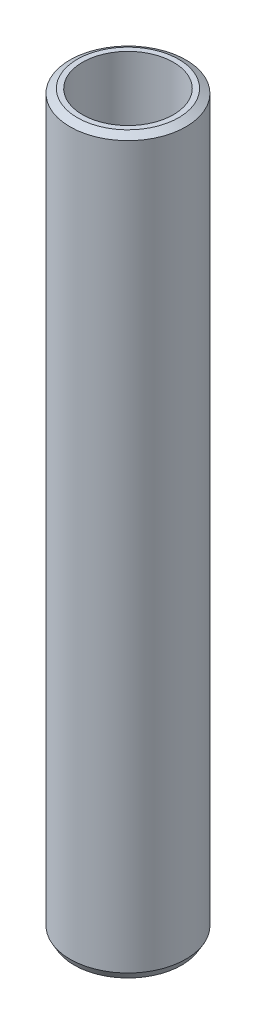
ISO-10303-21;
HEADER;
FILE_DESCRIPTION(('STEP AP214'),'2;1');
FILE_NAME('part.step','',(''),(''),'','','');
FILE_SCHEMA(('AUTOMOTIVE_DESIGN { 1 0 10303 214 1 1 1 1 }'));
ENDSEC;
DATA;
#1=APPLICATION_CONTEXT('core data for automotive mechanical design processes');
#2=APPLICATION_PROTOCOL_DEFINITION('international standard','automotive_design',2000,#1);
#3=PRODUCT_CONTEXT('',#1,'mechanical');
#4=PRODUCT('Part','Part','',(#3));
#5=PRODUCT_RELATED_PRODUCT_CATEGORY('part','',(#4));
#6=PRODUCT_DEFINITION_FORMATION('','',#4);
#7=PRODUCT_DEFINITION_CONTEXT('part definition',#1,'design');
#8=PRODUCT_DEFINITION('design','',#6,#7);
#9=PRODUCT_DEFINITION_SHAPE('','',#8);
#10=(LENGTH_UNIT() NAMED_UNIT(*) SI_UNIT(.MILLI.,.METRE.));
#11=(NAMED_UNIT(*) PLANE_ANGLE_UNIT() SI_UNIT($,.RADIAN.));
#12=(NAMED_UNIT(*) SI_UNIT($,.STERADIAN.) SOLID_ANGLE_UNIT());
#13=UNCERTAINTY_MEASURE_WITH_UNIT(LENGTH_MEASURE(1.E-05),#10,'distance_accuracy_value','');
#14=(GEOMETRIC_REPRESENTATION_CONTEXT(3) GLOBAL_UNCERTAINTY_ASSIGNED_CONTEXT((#13)) GLOBAL_UNIT_ASSIGNED_CONTEXT((#10,
#11,#12)) REPRESENTATION_CONTEXT('',''));
#15=CARTESIAN_POINT('',(0.,0.,0.));
#16=DIRECTION('',(0.,0.,1.));
#17=DIRECTION('',(1.,0.,0.));
#18=AXIS2_PLACEMENT_3D('',#15,#16,#17);
#19=CARTESIAN_POINT('',(0.,600.,0.));
#20=DIRECTION('',(0.,-1.,0.));
#21=DIRECTION('',(0.,0.,-1.));
#22=AXIS2_PLACEMENT_3D('',#19,#20,#21);
#23=CYLINDRICAL_SURFACE('',#22,47.5);
#24=CARTESIAN_POINT('',(0.,596.544630793813,0.));
#25=DIRECTION('',(0.,1.,0.));
#26=DIRECTION('',(0.,0.,1.));
#27=AXIS2_PLACEMENT_3D('',#24,#25,#26);
#28=CIRCLE('',#27,47.5);
#29=CARTESIAN_POINT('',(0.,596.544630793813,47.5));
#30=VERTEX_POINT('',#29);
#31=EDGE_CURVE('E50',#30,#30,#28,.F.);
#32=ORIENTED_EDGE('',*,*,#31,.T.);
#33=EDGE_LOOP('',(#32));
#34=FACE_BOUND('',#33,.T.);
#35=CARTESIAN_POINT('',(0.,5.98487502402389,0.));
#36=DIRECTION('',(0.,1.,0.));
#37=DIRECTION('',(0.,0.,1.));
#38=AXIS2_PLACEMENT_3D('',#35,#36,#37);
#39=CIRCLE('',#38,47.5);
#40=CARTESIAN_POINT('',(0.,5.98487502402389,47.5));
#41=VERTEX_POINT('',#40);
#42=EDGE_CURVE('E51',#41,#41,#39,.T.);
#43=ORIENTED_EDGE('',*,*,#42,.T.);
#44=EDGE_LOOP('',(#43));
#45=FACE_BOUND('',#44,.T.);
#46=ADVANCED_FACE('F39',(#34,#45),#23,.T.);
#47=CARTESIAN_POINT('',(0.,600.,0.));
#48=DIRECTION('',(0.,1.,0.));
#49=DIRECTION('',(0.,0.,1.));
#50=AXIS2_PLACEMENT_3D('',#47,#48,#49);
#51=PLANE('',#50);
#52=CARTESIAN_POINT('',(0.,600.,0.));
#53=DIRECTION('',(0.,1.,0.));
#54=DIRECTION('',(0.,0.,1.));
#55=AXIS2_PLACEMENT_3D('',#52,#53,#54);
#56=CIRCLE('',#55,41.5151249759758);
#57=CARTESIAN_POINT('',(0.,600.,41.5151249759758));
#58=VERTEX_POINT('',#57);
#59=EDGE_CURVE('E54',#58,#58,#56,.T.);
#60=ORIENTED_EDGE('',*,*,#59,.T.);
#61=EDGE_LOOP('',(#60));
#62=FACE_BOUND('',#61,.T.);
#63=CARTESIAN_POINT('',(0.,600.,0.));
#64=DIRECTION('',(0.,1.,0.));
#65=DIRECTION('',(0.,0.,1.));
#66=AXIS2_PLACEMENT_3D('',#63,#64,#65);
#67=CIRCLE('',#66,37.2601725460857);
#68=CARTESIAN_POINT('',(0.,600.,37.2601725460857));
#69=VERTEX_POINT('',#68);
#70=EDGE_CURVE('E58',#69,#69,#67,.T.);
#71=ORIENTED_EDGE('',*,*,#70,.F.);
#72=EDGE_LOOP('',(#71));
#73=FACE_BOUND('',#72,.T.);
#74=ADVANCED_FACE('F69',(#62,#73),#51,.T.);
#75=CARTESIAN_POINT('',(0.,0.,0.));
#76=DIRECTION('',(0.,1.,0.));
#77=DIRECTION('',(0.,0.,1.));
#78=AXIS2_PLACEMENT_3D('',#75,#76,#77);
#79=PLANE('',#78);
#80=CARTESIAN_POINT('',(0.,0.,0.));
#81=DIRECTION('',(0.,1.,0.));
#82=DIRECTION('',(0.,0.,1.));
#83=AXIS2_PLACEMENT_3D('',#80,#81,#82);
#84=CIRCLE('',#83,44.0446307938135);
#85=CARTESIAN_POINT('',(0.,0.,44.0446307938135));
#86=VERTEX_POINT('',#85);
#87=EDGE_CURVE('E10',#86,#86,#84,.F.);
#88=ORIENTED_EDGE('',*,*,#87,.T.);
#89=EDGE_LOOP('',(#88));
#90=FACE_BOUND('',#89,.T.);
#91=CARTESIAN_POINT('',(0.,0.,0.));
#92=DIRECTION('',(0.,1.,0.));
#93=DIRECTION('',(0.,0.,1.));
#94=AXIS2_PLACEMENT_3D('',#91,#92,#93);
#95=CIRCLE('',#94,37.2601725460857);
#96=CARTESIAN_POINT('',(0.,0.,37.2601725460857));
#97=VERTEX_POINT('',#96);
#98=EDGE_CURVE('E63',#97,#97,#95,.T.);
#99=ORIENTED_EDGE('',*,*,#98,.T.);
#100=EDGE_LOOP('',(#99));
#101=FACE_BOUND('',#100,.T.);
#102=ADVANCED_FACE('F75',(#90,#101),#79,.F.);
#103=CARTESIAN_POINT('',(0.,600.,0.));
#104=DIRECTION('',(0.,-1.,0.));
#105=DIRECTION('',(0.,0.,-1.));
#106=AXIS2_PLACEMENT_3D('',#103,#104,#105);
#107=CYLINDRICAL_SURFACE('',#106,37.2601725460857);
#108=ORIENTED_EDGE('',*,*,#70,.T.);
#109=EDGE_LOOP('',(#108));
#110=FACE_BOUND('',#109,.T.);
#111=ORIENTED_EDGE('',*,*,#98,.F.);
#112=EDGE_LOOP('',(#111));
#113=FACE_BOUND('',#112,.T.);
#114=ADVANCED_FACE('F70',(#110,#113),#107,.F.);
#115=CARTESIAN_POINT('',(0.,600.,0.));
#116=DIRECTION('',(0.,-1.,0.));
#117=DIRECTION('',(0.,0.,-1.));
#118=AXIS2_PLACEMENT_3D('',#115,#116,#117);
#119=CONICAL_SURFACE('',#118,41.5151249759758,1.04719755119661);
#120=ORIENTED_EDGE('',*,*,#31,.F.);
#121=EDGE_LOOP('',(#120));
#122=FACE_BOUND('',#121,.T.);
#123=ORIENTED_EDGE('',*,*,#59,.F.);
#124=EDGE_LOOP('',(#123));
#125=FACE_BOUND('',#124,.T.);
#126=ADVANCED_FACE('F81',(#122,#125),#119,.T.);
#127=CARTESIAN_POINT('',(0.,5.98487502402389,0.));
#128=DIRECTION('',(0.,1.,0.));
#129=DIRECTION('',(0.,0.,1.));
#130=AXIS2_PLACEMENT_3D('',#127,#128,#129);
#131=CONICAL_SURFACE('',#130,47.5,0.523598775598306);
#132=ORIENTED_EDGE('',*,*,#87,.F.);
#133=EDGE_LOOP('',(#132));
#134=FACE_BOUND('',#133,.T.);
#135=ORIENTED_EDGE('',*,*,#42,.F.);
#136=EDGE_LOOP('',(#135));
#137=FACE_BOUND('',#136,.T.);
#138=ADVANCED_FACE('F45',(#134,#137),#131,.T.);
#139=CLOSED_SHELL('',(#46,#74,#102,#114,#126,#138));
#140=MANIFOLD_SOLID_BREP('B2',#139);
#141=ADVANCED_BREP_SHAPE_REPRESENTATION('',(#18,#140),#14);
#142=SHAPE_DEFINITION_REPRESENTATION(#9,#141);
ENDSEC;
END-ISO-10303-21;
